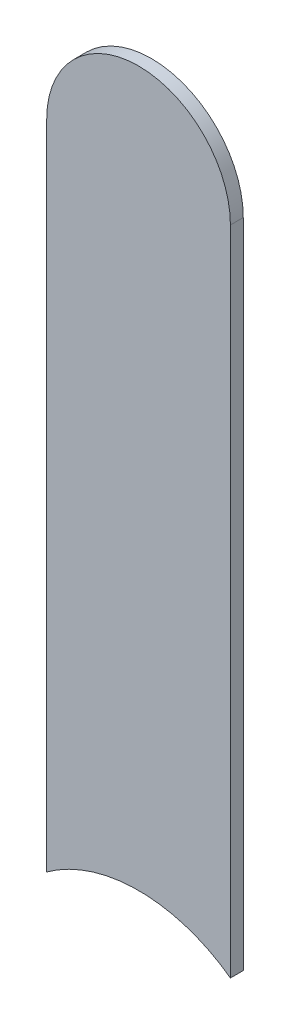
ISO-10303-21;
HEADER;
FILE_DESCRIPTION(('STEP AP214'),'2;1');
FILE_NAME('part.step','',(''),(''),'','','');
FILE_SCHEMA(('AUTOMOTIVE_DESIGN { 1 0 10303 214 1 1 1 1 }'));
ENDSEC;
DATA;
#1=APPLICATION_CONTEXT('core data for automotive mechanical design processes');
#2=APPLICATION_PROTOCOL_DEFINITION('international standard','automotive_design',2000,#1);
#3=PRODUCT_CONTEXT('',#1,'mechanical');
#4=PRODUCT('Part','Part','',(#3));
#5=PRODUCT_RELATED_PRODUCT_CATEGORY('part','',(#4));
#6=PRODUCT_DEFINITION_FORMATION('','',#4);
#7=PRODUCT_DEFINITION_CONTEXT('part definition',#1,'design');
#8=PRODUCT_DEFINITION('design','',#6,#7);
#9=PRODUCT_DEFINITION_SHAPE('','',#8);
#10=(LENGTH_UNIT() NAMED_UNIT(*) SI_UNIT(.MILLI.,.METRE.));
#11=(NAMED_UNIT(*) PLANE_ANGLE_UNIT() SI_UNIT($,.RADIAN.));
#12=(NAMED_UNIT(*) SI_UNIT($,.STERADIAN.) SOLID_ANGLE_UNIT());
#13=UNCERTAINTY_MEASURE_WITH_UNIT(LENGTH_MEASURE(1.E-05),#10,'distance_accuracy_value','');
#14=(GEOMETRIC_REPRESENTATION_CONTEXT(3) GLOBAL_UNCERTAINTY_ASSIGNED_CONTEXT((#13)) GLOBAL_UNIT_ASSIGNED_CONTEXT((#10,
#11,#12)) REPRESENTATION_CONTEXT('',''));
#15=CARTESIAN_POINT('',(0.,0.,0.));
#16=DIRECTION('',(0.,0.,1.));
#17=DIRECTION('',(1.,0.,0.));
#18=AXIS2_PLACEMENT_3D('',#15,#16,#17);
#19=CARTESIAN_POINT('',(172.208,-153.249,-0.035));
#20=DIRECTION('',(-1.,0.,0.));
#21=DIRECTION('',(0.,0.,1.));
#22=AXIS2_PLACEMENT_3D('',#19,#20,#21);
#23=PLANE('',#22);
#24=DIRECTION('',(0.,0.,1.));
#25=VECTOR('',#24,1.);
#26=CARTESIAN_POINT('',(172.208,-151.13,-0.035));
#27=LINE('',#26,#25);
#28=CARTESIAN_POINT('',(172.208,-151.13,-0.035));
#29=VERTEX_POINT('',#28);
#30=CARTESIAN_POINT('',(172.208,-151.13,0.));
#31=VERTEX_POINT('',#30);
#32=EDGE_CURVE('E11',#29,#31,#27,.T.);
#33=ORIENTED_EDGE('',*,*,#32,.T.);
#34=DIRECTION('',(0.,1.,0.));
#35=VECTOR('',#34,1.);
#36=CARTESIAN_POINT('',(172.208,-153.249,0.));
#37=LINE('',#36,#35);
#38=CARTESIAN_POINT('',(172.208,-152.9053068228,0.));
#39=VERTEX_POINT('',#38);
#40=EDGE_CURVE('E20',#39,#31,#37,.T.);
#41=ORIENTED_EDGE('',*,*,#40,.F.);
#42=DIRECTION('',(0.,0.,-1.));
#43=VECTOR('',#42,1.);
#44=CARTESIAN_POINT('',(172.208,-152.9053068228,-0.045));
#45=LINE('',#44,#43);
#46=CARTESIAN_POINT('',(172.208,-152.9053068228,-0.035));
#47=VERTEX_POINT('',#46);
#48=EDGE_CURVE('E57',#39,#47,#45,.T.);
#49=ORIENTED_EDGE('',*,*,#48,.T.);
#50=DIRECTION('',(0.,1.,0.));
#51=VECTOR('',#50,1.);
#52=CARTESIAN_POINT('',(172.208,-153.249,-0.035));
#53=LINE('',#52,#51);
#54=EDGE_CURVE('E107',#47,#29,#53,.T.);
#55=ORIENTED_EDGE('',*,*,#54,.T.);
#56=EDGE_LOOP('',(#33,#41,#49,#55));
#57=FACE_BOUND('',#56,.T.);
#58=ADVANCED_FACE('F17',(#57),#23,.F.);
#59=CARTESIAN_POINT('',(171.958,-151.13,-0.035));
#60=DIRECTION('',(0.,0.,-1.));
#61=DIRECTION('',(1.,0.,0.));
#62=AXIS2_PLACEMENT_3D('',#59,#60,#61);
#63=CYLINDRICAL_SURFACE('',#62,0.25);
#64=CARTESIAN_POINT('',(171.958,-151.13,-0.035));
#65=DIRECTION('',(0.,0.,1.));
#66=DIRECTION('',(1.,0.,0.));
#67=AXIS2_PLACEMENT_3D('',#64,#65,#66);
#68=CIRCLE('',#67,0.25);
#69=CARTESIAN_POINT('',(171.708,-151.13,-0.035));
#70=VERTEX_POINT('',#69);
#71=EDGE_CURVE('E83',#29,#70,#68,.T.);
#72=ORIENTED_EDGE('',*,*,#71,.T.);
#73=DIRECTION('',(0.,0.,1.));
#74=VECTOR('',#73,1.);
#75=CARTESIAN_POINT('',(171.708,-151.13,-0.035));
#76=LINE('',#75,#74);
#77=CARTESIAN_POINT('',(171.708,-151.13,0.));
#78=VERTEX_POINT('',#77);
#79=EDGE_CURVE('E81',#70,#78,#76,.T.);
#80=ORIENTED_EDGE('',*,*,#79,.T.);
#81=CARTESIAN_POINT('',(171.958,-151.13,0.));
#82=DIRECTION('',(0.,0.,1.));
#83=DIRECTION('',(1.,0.,0.));
#84=AXIS2_PLACEMENT_3D('',#81,#82,#83);
#85=CIRCLE('',#84,0.25);
#86=EDGE_CURVE('E72',#31,#78,#85,.T.);
#87=ORIENTED_EDGE('',*,*,#86,.F.);
#88=ORIENTED_EDGE('',*,*,#32,.F.);
#89=EDGE_LOOP('',(#72,#80,#87,#88));
#90=FACE_BOUND('',#89,.T.);
#91=ADVANCED_FACE('F82',(#90),#63,.T.);
#92=CARTESIAN_POINT('',(171.708,-151.13,0.));
#93=DIRECTION('',(0.,0.,1.));
#94=DIRECTION('',(1.,0.,0.));
#95=AXIS2_PLACEMENT_3D('',#92,#93,#94);
#96=PLANE('',#95);
#97=ORIENTED_EDGE('',*,*,#86,.T.);
#98=DIRECTION('',(0.,-1.,0.));
#99=VECTOR('',#98,1.);
#100=CARTESIAN_POINT('',(171.708,-151.13,0.));
#101=LINE('',#100,#99);
#102=CARTESIAN_POINT('',(171.708,-152.9053068228,0.));
#103=VERTEX_POINT('',#102);
#104=EDGE_CURVE('E77',#78,#103,#101,.T.);
#105=ORIENTED_EDGE('',*,*,#104,.T.);
#106=CARTESIAN_POINT('',(171.958,-153.249,0.));
#107=DIRECTION('',(0.,0.,-1.));
#108=DIRECTION('',(0.,-1.,0.));
#109=AXIS2_PLACEMENT_3D('',#106,#107,#108);
#110=CIRCLE('',#109,0.425);
#111=EDGE_CURVE('E102',#103,#39,#110,.T.);
#112=ORIENTED_EDGE('',*,*,#111,.T.);
#113=ORIENTED_EDGE('',*,*,#40,.T.);
#114=EDGE_LOOP('',(#97,#105,#112,#113));
#115=FACE_BOUND('',#114,.T.);
#116=ADVANCED_FACE('F74',(#115),#96,.T.);
#117=CARTESIAN_POINT('',(171.958,-153.249,-0.045));
#118=DIRECTION('',(0.,0.,-1.));
#119=DIRECTION('',(0.,-1.,0.));
#120=AXIS2_PLACEMENT_3D('',#117,#118,#119);
#121=CYLINDRICAL_SURFACE('',#120,0.425);
#122=ORIENTED_EDGE('',*,*,#111,.F.);
#123=DIRECTION('',(0.,0.,-1.));
#124=VECTOR('',#123,1.);
#125=CARTESIAN_POINT('',(171.708,-152.9053068228,-0.045));
#126=LINE('',#125,#124);
#127=CARTESIAN_POINT('',(171.708,-152.9053068228,-0.035));
#128=VERTEX_POINT('',#127);
#129=EDGE_CURVE('E92',#103,#128,#126,.T.);
#130=ORIENTED_EDGE('',*,*,#129,.T.);
#131=CARTESIAN_POINT('',(171.958,-153.249,-0.035));
#132=DIRECTION('',(0.,0.,-1.));
#133=DIRECTION('',(0.,-1.,0.));
#134=AXIS2_PLACEMENT_3D('',#131,#132,#133);
#135=CIRCLE('',#134,0.425);
#136=EDGE_CURVE('E110',#128,#47,#135,.T.);
#137=ORIENTED_EDGE('',*,*,#136,.T.);
#138=ORIENTED_EDGE('',*,*,#48,.F.);
#139=EDGE_LOOP('',(#122,#130,#137,#138));
#140=FACE_BOUND('',#139,.T.);
#141=ADVANCED_FACE('F170',(#140),#121,.F.);
#142=CARTESIAN_POINT('',(171.708,-151.13,-0.035));
#143=DIRECTION('',(0.,0.,1.));
#144=DIRECTION('',(1.,0.,0.));
#145=AXIS2_PLACEMENT_3D('',#142,#143,#144);
#146=PLANE('',#145);
#147=ORIENTED_EDGE('',*,*,#54,.F.);
#148=ORIENTED_EDGE('',*,*,#136,.F.);
#149=DIRECTION('',(0.,-1.,0.));
#150=VECTOR('',#149,1.);
#151=CARTESIAN_POINT('',(171.708,-151.13,-0.035));
#152=LINE('',#151,#150);
#153=EDGE_CURVE('E88',#70,#128,#152,.T.);
#154=ORIENTED_EDGE('',*,*,#153,.F.);
#155=ORIENTED_EDGE('',*,*,#71,.F.);
#156=EDGE_LOOP('',(#147,#148,#154,#155));
#157=FACE_BOUND('',#156,.T.);
#158=ADVANCED_FACE('F160',(#157),#146,.F.);
#159=CARTESIAN_POINT('',(171.708,-151.13,-0.035));
#160=DIRECTION('',(1.,0.,0.));
#161=DIRECTION('',(0.,1.,0.));
#162=AXIS2_PLACEMENT_3D('',#159,#160,#161);
#163=PLANE('',#162);
#164=ORIENTED_EDGE('',*,*,#129,.F.);
#165=ORIENTED_EDGE('',*,*,#104,.F.);
#166=ORIENTED_EDGE('',*,*,#79,.F.);
#167=ORIENTED_EDGE('',*,*,#153,.T.);
#168=EDGE_LOOP('',(#164,#165,#166,#167));
#169=FACE_BOUND('',#168,.T.);
#170=ADVANCED_FACE('F90',(#169),#163,.F.);
#171=CLOSED_SHELL('',(#58,#91,#116,#141,#158,#170));
#172=MANIFOLD_SOLID_BREP('B1',#171);
#173=ADVANCED_BREP_SHAPE_REPRESENTATION('',(#18,#172),#14);
#174=SHAPE_DEFINITION_REPRESENTATION(#9,#173);
ENDSEC;
END-ISO-10303-21;
